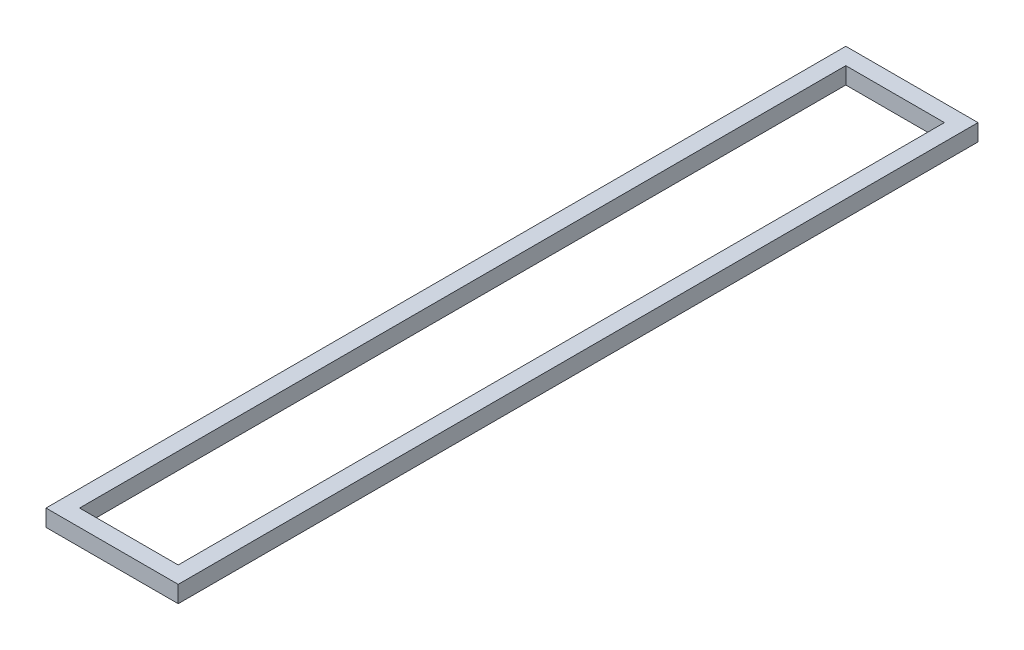
ISO-10303-21;
HEADER;
FILE_DESCRIPTION(('STEP AP214'),'2;1');
FILE_NAME('part.step','',(''),(''),'','','');
FILE_SCHEMA(('AUTOMOTIVE_DESIGN { 1 0 10303 214 1 1 1 1 }'));
ENDSEC;
DATA;
#1=APPLICATION_CONTEXT('core data for automotive mechanical design processes');
#2=APPLICATION_PROTOCOL_DEFINITION('international standard','automotive_design',2000,#1);
#3=PRODUCT_CONTEXT('',#1,'mechanical');
#4=PRODUCT('Part','Part','',(#3));
#5=PRODUCT_RELATED_PRODUCT_CATEGORY('part','',(#4));
#6=PRODUCT_DEFINITION_FORMATION('','',#4);
#7=PRODUCT_DEFINITION_CONTEXT('part definition',#1,'design');
#8=PRODUCT_DEFINITION('design','',#6,#7);
#9=PRODUCT_DEFINITION_SHAPE('','',#8);
#10=(LENGTH_UNIT() NAMED_UNIT(*) SI_UNIT(.MILLI.,.METRE.));
#11=(NAMED_UNIT(*) PLANE_ANGLE_UNIT() SI_UNIT($,.RADIAN.));
#12=(NAMED_UNIT(*) SI_UNIT($,.STERADIAN.) SOLID_ANGLE_UNIT());
#13=UNCERTAINTY_MEASURE_WITH_UNIT(LENGTH_MEASURE(1.E-05),#10,'distance_accuracy_value','');
#14=(GEOMETRIC_REPRESENTATION_CONTEXT(3) GLOBAL_UNCERTAINTY_ASSIGNED_CONTEXT((#13)) GLOBAL_UNIT_ASSIGNED_CONTEXT((#10,
#11,#12)) REPRESENTATION_CONTEXT('',''));
#15=CARTESIAN_POINT('',(0.,0.,0.));
#16=DIRECTION('',(0.,0.,1.));
#17=DIRECTION('',(1.,0.,0.));
#18=AXIS2_PLACEMENT_3D('',#15,#16,#17);
#19=CARTESIAN_POINT('',(-100.,0.,-605.));
#20=DIRECTION('',(-1.,0.,0.));
#21=DIRECTION('',(0.,0.,1.));
#22=AXIS2_PLACEMENT_3D('',#19,#20,#21);
#23=PLANE('',#22);
#24=DIRECTION('',(0.,0.,1.));
#25=VECTOR('',#24,1.);
#26=CARTESIAN_POINT('',(-100.,0.,-605.));
#27=LINE('',#26,#25);
#28=CARTESIAN_POINT('',(-100.,0.,-605.));
#29=VERTEX_POINT('',#28);
#30=CARTESIAN_POINT('',(-100.,0.,605.));
#31=VERTEX_POINT('',#30);
#32=EDGE_CURVE('E133',#29,#31,#27,.T.);
#33=ORIENTED_EDGE('',*,*,#32,.T.);
#34=DIRECTION('',(0.,-1.,0.));
#35=VECTOR('',#34,1.);
#36=CARTESIAN_POINT('',(-99.9999999999999,0.,605.));
#37=LINE('',#36,#35);
#38=CARTESIAN_POINT('',(-100.,25.4,605.));
#39=VERTEX_POINT('',#38);
#40=EDGE_CURVE('E168',#39,#31,#37,.T.);
#41=ORIENTED_EDGE('',*,*,#40,.F.);
#42=DIRECTION('',(0.,0.,1.));
#43=VECTOR('',#42,1.);
#44=CARTESIAN_POINT('',(-100.,25.4,-605.));
#45=LINE('',#44,#43);
#46=CARTESIAN_POINT('',(-100.,25.4,-605.));
#47=VERTEX_POINT('',#46);
#48=EDGE_CURVE('E148',#47,#39,#45,.T.);
#49=ORIENTED_EDGE('',*,*,#48,.F.);
#50=DIRECTION('',(0.,-1.,0.));
#51=VECTOR('',#50,1.);
#52=CARTESIAN_POINT('',(-100.,0.,-605.));
#53=LINE('',#52,#51);
#54=EDGE_CURVE('E223',#47,#29,#53,.T.);
#55=ORIENTED_EDGE('',*,*,#54,.T.);
#56=EDGE_LOOP('',(#33,#41,#49,#55));
#57=FACE_BOUND('',#56,.T.);
#58=ADVANCED_FACE('F37',(#57),#23,.T.);
#59=CARTESIAN_POINT('',(-74.6000000000002,0.,-605.));
#60=DIRECTION('',(1.,0.,0.));
#61=DIRECTION('',(0.,0.,-1.));
#62=AXIS2_PLACEMENT_3D('',#59,#60,#61);
#63=PLANE('',#62);
#64=DIRECTION('',(0.,0.,1.));
#65=VECTOR('',#64,1.);
#66=CARTESIAN_POINT('',(-74.6000000000002,25.4,-605.));
#67=LINE('',#66,#65);
#68=CARTESIAN_POINT('',(-74.6000000000002,25.4,-579.6));
#69=VERTEX_POINT('',#68);
#70=CARTESIAN_POINT('',(-74.6,25.4,579.6));
#71=VERTEX_POINT('',#70);
#72=EDGE_CURVE('E41',#69,#71,#67,.T.);
#73=ORIENTED_EDGE('',*,*,#72,.T.);
#74=DIRECTION('',(0.,-1.,0.));
#75=VECTOR('',#74,1.);
#76=CARTESIAN_POINT('',(-74.6,0.,579.6));
#77=LINE('',#76,#75);
#78=CARTESIAN_POINT('',(-74.6,0.,579.6));
#79=VERTEX_POINT('',#78);
#80=EDGE_CURVE('E140',#71,#79,#77,.T.);
#81=ORIENTED_EDGE('',*,*,#80,.T.);
#82=DIRECTION('',(0.,0.,1.));
#83=VECTOR('',#82,1.);
#84=CARTESIAN_POINT('',(-74.6000000000002,0.,-605.));
#85=LINE('',#84,#83);
#86=CARTESIAN_POINT('',(-74.6000000000002,0.,-579.6));
#87=VERTEX_POINT('',#86);
#88=EDGE_CURVE('E149',#87,#79,#85,.T.);
#89=ORIENTED_EDGE('',*,*,#88,.F.);
#90=DIRECTION('',(0.,-1.,0.));
#91=VECTOR('',#90,1.);
#92=CARTESIAN_POINT('',(-74.6000000000002,0.,-579.6));
#93=LINE('',#92,#91);
#94=EDGE_CURVE('E143',#69,#87,#93,.T.);
#95=ORIENTED_EDGE('',*,*,#94,.F.);
#96=EDGE_LOOP('',(#73,#81,#89,#95));
#97=FACE_BOUND('',#96,.T.);
#98=ADVANCED_FACE('F139',(#97),#63,.T.);
#99=CARTESIAN_POINT('',(-100.,25.4,-605.));
#100=DIRECTION('',(0.,1.,0.));
#101=DIRECTION('',(0.,0.,1.));
#102=AXIS2_PLACEMENT_3D('',#99,#100,#101);
#103=PLANE('',#102);
#104=DIRECTION('',(1.,0.,0.));
#105=VECTOR('',#104,1.);
#106=CARTESIAN_POINT('',(-99.9999999999999,25.4,579.6));
#107=LINE('',#106,#105);
#108=CARTESIAN_POINT('',(74.6000000000002,25.4,579.6));
#109=VERTEX_POINT('',#108);
#110=EDGE_CURVE('E153',#71,#109,#107,.T.);
#111=ORIENTED_EDGE('',*,*,#110,.F.);
#112=ORIENTED_EDGE('',*,*,#72,.F.);
#113=DIRECTION('',(-1.,0.,0.));
#114=VECTOR('',#113,1.);
#115=CARTESIAN_POINT('',(100.,25.4,-579.6));
#116=LINE('',#115,#114);
#117=CARTESIAN_POINT('',(74.6000000000001,25.4,-579.6));
#118=VERTEX_POINT('',#117);
#119=EDGE_CURVE('E182',#118,#69,#116,.T.);
#120=ORIENTED_EDGE('',*,*,#119,.F.);
#121=DIRECTION('',(0.,0.,-1.));
#122=VECTOR('',#121,1.);
#123=CARTESIAN_POINT('',(74.6000000000002,25.4,605.));
#124=LINE('',#123,#122);
#125=EDGE_CURVE('E163',#109,#118,#124,.T.);
#126=ORIENTED_EDGE('',*,*,#125,.F.);
#127=EDGE_LOOP('',(#111,#112,#120,#126));
#128=FACE_BOUND('',#127,.T.);
#129=ORIENTED_EDGE('',*,*,#48,.T.);
#130=DIRECTION('',(1.,0.,0.));
#131=VECTOR('',#130,1.);
#132=CARTESIAN_POINT('',(-99.9999999999999,25.4,605.));
#133=LINE('',#132,#131);
#134=CARTESIAN_POINT('',(100.,25.4,605.));
#135=VERTEX_POINT('',#134);
#136=EDGE_CURVE('E164',#39,#135,#133,.T.);
#137=ORIENTED_EDGE('',*,*,#136,.T.);
#138=DIRECTION('',(0.,0.,-1.));
#139=VECTOR('',#138,1.);
#140=CARTESIAN_POINT('',(100.,25.4,605.));
#141=LINE('',#140,#139);
#142=CARTESIAN_POINT('',(100.,25.4,-605.));
#143=VERTEX_POINT('',#142);
#144=EDGE_CURVE('E206',#135,#143,#141,.T.);
#145=ORIENTED_EDGE('',*,*,#144,.T.);
#146=DIRECTION('',(-1.,0.,0.));
#147=VECTOR('',#146,1.);
#148=CARTESIAN_POINT('',(100.,25.4,-605.));
#149=LINE('',#148,#147);
#150=EDGE_CURVE('E189',#143,#47,#149,.T.);
#151=ORIENTED_EDGE('',*,*,#150,.T.);
#152=EDGE_LOOP('',(#129,#137,#145,#151));
#153=FACE_BOUND('',#152,.T.);
#154=ADVANCED_FACE('F160',(#128,#153),#103,.T.);
#155=CARTESIAN_POINT('',(-100.,0.,-605.));
#156=DIRECTION('',(0.,-1.,0.));
#157=DIRECTION('',(0.,0.,-1.));
#158=AXIS2_PLACEMENT_3D('',#155,#156,#157);
#159=PLANE('',#158);
#160=DIRECTION('',(1.,0.,0.));
#161=VECTOR('',#160,1.);
#162=CARTESIAN_POINT('',(-99.9999999999999,0.,605.));
#163=LINE('',#162,#161);
#164=CARTESIAN_POINT('',(100.,0.,605.));
#165=VERTEX_POINT('',#164);
#166=EDGE_CURVE('E157',#31,#165,#163,.T.);
#167=ORIENTED_EDGE('',*,*,#166,.F.);
#168=ORIENTED_EDGE('',*,*,#32,.F.);
#169=DIRECTION('',(-1.,0.,0.));
#170=VECTOR('',#169,1.);
#171=CARTESIAN_POINT('',(100.,0.,-605.));
#172=LINE('',#171,#170);
#173=CARTESIAN_POINT('',(100.,0.,-605.));
#174=VERTEX_POINT('',#173);
#175=EDGE_CURVE('E186',#174,#29,#172,.T.);
#176=ORIENTED_EDGE('',*,*,#175,.F.);
#177=DIRECTION('',(0.,0.,-1.));
#178=VECTOR('',#177,1.);
#179=CARTESIAN_POINT('',(100.,0.,605.));
#180=LINE('',#179,#178);
#181=EDGE_CURVE('E204',#165,#174,#180,.T.);
#182=ORIENTED_EDGE('',*,*,#181,.F.);
#183=EDGE_LOOP('',(#167,#168,#176,#182));
#184=FACE_BOUND('',#183,.T.);
#185=ORIENTED_EDGE('',*,*,#88,.T.);
#186=DIRECTION('',(1.,0.,0.));
#187=VECTOR('',#186,1.);
#188=CARTESIAN_POINT('',(-99.9999999999999,0.,579.6));
#189=LINE('',#188,#187);
#190=CARTESIAN_POINT('',(74.6000000000002,0.,579.6));
#191=VERTEX_POINT('',#190);
#192=EDGE_CURVE('E156',#79,#191,#189,.T.);
#193=ORIENTED_EDGE('',*,*,#192,.T.);
#194=DIRECTION('',(0.,0.,-1.));
#195=VECTOR('',#194,1.);
#196=CARTESIAN_POINT('',(74.6000000000002,0.,605.));
#197=LINE('',#196,#195);
#198=CARTESIAN_POINT('',(74.6000000000001,0.,-579.6));
#199=VERTEX_POINT('',#198);
#200=EDGE_CURVE('E207',#191,#199,#197,.T.);
#201=ORIENTED_EDGE('',*,*,#200,.T.);
#202=DIRECTION('',(-1.,0.,0.));
#203=VECTOR('',#202,1.);
#204=CARTESIAN_POINT('',(100.,0.,-579.6));
#205=LINE('',#204,#203);
#206=EDGE_CURVE('E178',#199,#87,#205,.T.);
#207=ORIENTED_EDGE('',*,*,#206,.T.);
#208=EDGE_LOOP('',(#185,#193,#201,#207));
#209=FACE_BOUND('',#208,.T.);
#210=ADVANCED_FACE('F39',(#184,#209),#159,.T.);
#211=CARTESIAN_POINT('',(-99.9999999999999,0.,605.));
#212=DIRECTION('',(0.,0.,1.));
#213=DIRECTION('',(1.,0.,0.));
#214=AXIS2_PLACEMENT_3D('',#211,#212,#213);
#215=PLANE('',#214);
#216=ORIENTED_EDGE('',*,*,#166,.T.);
#217=DIRECTION('',(0.,-1.,0.));
#218=VECTOR('',#217,1.);
#219=CARTESIAN_POINT('',(100.,0.,605.));
#220=LINE('',#219,#218);
#221=EDGE_CURVE('E196',#135,#165,#220,.T.);
#222=ORIENTED_EDGE('',*,*,#221,.F.);
#223=ORIENTED_EDGE('',*,*,#136,.F.);
#224=ORIENTED_EDGE('',*,*,#40,.T.);
#225=EDGE_LOOP('',(#216,#222,#223,#224));
#226=FACE_BOUND('',#225,.T.);
#227=ADVANCED_FACE('F194',(#226),#215,.T.);
#228=CARTESIAN_POINT('',(-99.9999999999999,0.,579.6));
#229=DIRECTION('',(0.,0.,-1.));
#230=DIRECTION('',(-1.,0.,0.));
#231=AXIS2_PLACEMENT_3D('',#228,#229,#230);
#232=PLANE('',#231);
#233=ORIENTED_EDGE('',*,*,#110,.T.);
#234=DIRECTION('',(0.,-1.,0.));
#235=VECTOR('',#234,1.);
#236=CARTESIAN_POINT('',(74.6000000000002,0.,579.6));
#237=LINE('',#236,#235);
#238=EDGE_CURVE('E208',#109,#191,#237,.T.);
#239=ORIENTED_EDGE('',*,*,#238,.T.);
#240=ORIENTED_EDGE('',*,*,#192,.F.);
#241=ORIENTED_EDGE('',*,*,#80,.F.);
#242=EDGE_LOOP('',(#233,#239,#240,#241));
#243=FACE_BOUND('',#242,.T.);
#244=ADVANCED_FACE('F152',(#243),#232,.T.);
#245=CARTESIAN_POINT('',(100.,0.,-605.));
#246=DIRECTION('',(0.,0.,-1.));
#247=DIRECTION('',(-1.,0.,0.));
#248=AXIS2_PLACEMENT_3D('',#245,#246,#247);
#249=PLANE('',#248);
#250=ORIENTED_EDGE('',*,*,#175,.T.);
#251=ORIENTED_EDGE('',*,*,#54,.F.);
#252=ORIENTED_EDGE('',*,*,#150,.F.);
#253=DIRECTION('',(0.,-1.,0.));
#254=VECTOR('',#253,1.);
#255=CARTESIAN_POINT('',(100.,0.,-605.));
#256=LINE('',#255,#254);
#257=EDGE_CURVE('E213',#143,#174,#256,.T.);
#258=ORIENTED_EDGE('',*,*,#257,.T.);
#259=EDGE_LOOP('',(#250,#251,#252,#258));
#260=FACE_BOUND('',#259,.T.);
#261=ADVANCED_FACE('F226',(#260),#249,.T.);
#262=CARTESIAN_POINT('',(100.,0.,-579.6));
#263=DIRECTION('',(0.,0.,1.));
#264=DIRECTION('',(1.,0.,0.));
#265=AXIS2_PLACEMENT_3D('',#262,#263,#264);
#266=PLANE('',#265);
#267=ORIENTED_EDGE('',*,*,#119,.T.);
#268=ORIENTED_EDGE('',*,*,#94,.T.);
#269=ORIENTED_EDGE('',*,*,#206,.F.);
#270=DIRECTION('',(0.,-1.,0.));
#271=VECTOR('',#270,1.);
#272=CARTESIAN_POINT('',(74.6000000000001,0.,-579.6));
#273=LINE('',#272,#271);
#274=EDGE_CURVE('E212',#118,#199,#273,.T.);
#275=ORIENTED_EDGE('',*,*,#274,.F.);
#276=EDGE_LOOP('',(#267,#268,#269,#275));
#277=FACE_BOUND('',#276,.T.);
#278=ADVANCED_FACE('F180',(#277),#266,.T.);
#279=CARTESIAN_POINT('',(100.,0.,605.));
#280=DIRECTION('',(1.,0.,0.));
#281=DIRECTION('',(0.,0.,-1.));
#282=AXIS2_PLACEMENT_3D('',#279,#280,#281);
#283=PLANE('',#282);
#284=ORIENTED_EDGE('',*,*,#181,.T.);
#285=ORIENTED_EDGE('',*,*,#257,.F.);
#286=ORIENTED_EDGE('',*,*,#144,.F.);
#287=ORIENTED_EDGE('',*,*,#221,.T.);
#288=EDGE_LOOP('',(#284,#285,#286,#287));
#289=FACE_BOUND('',#288,.T.);
#290=ADVANCED_FACE('F202',(#289),#283,.T.);
#291=CARTESIAN_POINT('',(74.6000000000002,0.,605.));
#292=DIRECTION('',(-1.,0.,0.));
#293=DIRECTION('',(0.,0.,1.));
#294=AXIS2_PLACEMENT_3D('',#291,#292,#293);
#295=PLANE('',#294);
#296=ORIENTED_EDGE('',*,*,#238,.F.);
#297=ORIENTED_EDGE('',*,*,#125,.T.);
#298=ORIENTED_EDGE('',*,*,#274,.T.);
#299=ORIENTED_EDGE('',*,*,#200,.F.);
#300=EDGE_LOOP('',(#296,#297,#298,#299));
#301=FACE_BOUND('',#300,.T.);
#302=ADVANCED_FACE('F330',(#301),#295,.T.);
#303=CLOSED_SHELL('',(#58,#98,#154,#210,#227,#244,#261,#278,#290,#302));
#304=CARTESIAN_POINT('',(-98.8000000000002,1.2,-605.));
#305=DIRECTION('',(1.,0.,0.));
#306=DIRECTION('',(0.,0.,-1.));
#307=AXIS2_PLACEMENT_3D('',#304,#305,#306);
#308=PLANE('',#307);
#309=DIRECTION('',(0.,0.,1.));
#310=VECTOR('',#309,1.);
#311=CARTESIAN_POINT('',(-98.8000000000002,24.2,-605.));
#312=LINE('',#311,#310);
#313=CARTESIAN_POINT('',(-98.8000000000002,24.2,-603.8));
#314=VERTEX_POINT('',#313);
#315=CARTESIAN_POINT('',(-98.8,24.2,603.8));
#316=VERTEX_POINT('',#315);
#317=EDGE_CURVE('E229',#314,#316,#312,.T.);
#318=ORIENTED_EDGE('',*,*,#317,.T.);
#319=DIRECTION('',(0.,-1.,0.));
#320=VECTOR('',#319,1.);
#321=CARTESIAN_POINT('',(-98.8,1.2,603.8));
#322=LINE('',#321,#320);
#323=CARTESIAN_POINT('',(-98.8,1.2,603.8));
#324=VERTEX_POINT('',#323);
#325=EDGE_CURVE('E231',#316,#324,#322,.T.);
#326=ORIENTED_EDGE('',*,*,#325,.T.);
#327=DIRECTION('',(0.,0.,1.));
#328=VECTOR('',#327,1.);
#329=CARTESIAN_POINT('',(-98.8000000000002,1.2,-605.));
#330=LINE('',#329,#328);
#331=CARTESIAN_POINT('',(-98.8000000000002,1.2,-603.8));
#332=VERTEX_POINT('',#331);
#333=EDGE_CURVE('E215',#332,#324,#330,.T.);
#334=ORIENTED_EDGE('',*,*,#333,.F.);
#335=DIRECTION('',(0.,-1.,0.));
#336=VECTOR('',#335,1.);
#337=CARTESIAN_POINT('',(-98.8000000000002,1.2,-603.8));
#338=LINE('',#337,#336);
#339=EDGE_CURVE('E258',#314,#332,#338,.T.);
#340=ORIENTED_EDGE('',*,*,#339,.F.);
#341=EDGE_LOOP('',(#318,#326,#334,#340));
#342=FACE_BOUND('',#341,.T.);
#343=ADVANCED_FACE('F314',(#342),#308,.T.);
#344=CARTESIAN_POINT('',(-75.8000000000002,1.2,-605.));
#345=DIRECTION('',(-1.,0.,0.));
#346=DIRECTION('',(0.,0.,1.));
#347=AXIS2_PLACEMENT_3D('',#344,#345,#346);
#348=PLANE('',#347);
#349=DIRECTION('',(0.,0.,1.));
#350=VECTOR('',#349,1.);
#351=CARTESIAN_POINT('',(-75.8000000000002,1.2,-605.));
#352=LINE('',#351,#350);
#353=CARTESIAN_POINT('',(-75.8000000000002,1.2,-580.8));
#354=VERTEX_POINT('',#353);
#355=CARTESIAN_POINT('',(-75.8,1.2,580.8));
#356=VERTEX_POINT('',#355);
#357=EDGE_CURVE('E234',#354,#356,#352,.T.);
#358=ORIENTED_EDGE('',*,*,#357,.T.);
#359=DIRECTION('',(0.,1.,0.));
#360=VECTOR('',#359,1.);
#361=CARTESIAN_POINT('',(-75.7999999999999,1.2,580.8));
#362=LINE('',#361,#360);
#363=CARTESIAN_POINT('',(-75.8,24.2,580.8));
#364=VERTEX_POINT('',#363);
#365=EDGE_CURVE('E250',#356,#364,#362,.T.);
#366=ORIENTED_EDGE('',*,*,#365,.T.);
#367=DIRECTION('',(0.,0.,1.));
#368=VECTOR('',#367,1.);
#369=CARTESIAN_POINT('',(-75.8000000000002,24.2,-605.));
#370=LINE('',#369,#368);
#371=CARTESIAN_POINT('',(-75.8000000000002,24.2,-580.8));
#372=VERTEX_POINT('',#371);
#373=EDGE_CURVE('E232',#372,#364,#370,.T.);
#374=ORIENTED_EDGE('',*,*,#373,.F.);
#375=DIRECTION('',(0.,1.,0.));
#376=VECTOR('',#375,1.);
#377=CARTESIAN_POINT('',(-75.8000000000002,1.2,-580.8));
#378=LINE('',#377,#376);
#379=EDGE_CURVE('E267',#354,#372,#378,.T.);
#380=ORIENTED_EDGE('',*,*,#379,.F.);
#381=EDGE_LOOP('',(#358,#366,#374,#380));
#382=FACE_BOUND('',#381,.T.);
#383=ADVANCED_FACE('F316',(#382),#348,.T.);
#384=CARTESIAN_POINT('',(-99.9999999999999,1.2,603.8));
#385=DIRECTION('',(0.,0.,-1.));
#386=DIRECTION('',(-1.,0.,0.));
#387=AXIS2_PLACEMENT_3D('',#384,#385,#386);
#388=PLANE('',#387);
#389=DIRECTION('',(1.,0.,0.));
#390=VECTOR('',#389,1.);
#391=CARTESIAN_POINT('',(-99.9999999999999,24.2,603.8));
#392=LINE('',#391,#390);
#393=CARTESIAN_POINT('',(98.8000000000002,24.2,603.8));
#394=VERTEX_POINT('',#393);
#395=EDGE_CURVE('E237',#316,#394,#392,.T.);
#396=ORIENTED_EDGE('',*,*,#395,.T.);
#397=DIRECTION('',(0.,-1.,0.));
#398=VECTOR('',#397,1.);
#399=CARTESIAN_POINT('',(98.8000000000002,1.2,603.8));
#400=LINE('',#399,#398);
#401=CARTESIAN_POINT('',(98.8000000000002,1.2,603.8));
#402=VERTEX_POINT('',#401);
#403=EDGE_CURVE('E268',#394,#402,#400,.T.);
#404=ORIENTED_EDGE('',*,*,#403,.T.);
#405=DIRECTION('',(1.,0.,0.));
#406=VECTOR('',#405,1.);
#407=CARTESIAN_POINT('',(-99.9999999999999,1.2,603.8));
#408=LINE('',#407,#406);
#409=EDGE_CURVE('E247',#324,#402,#408,.T.);
#410=ORIENTED_EDGE('',*,*,#409,.F.);
#411=ORIENTED_EDGE('',*,*,#325,.F.);
#412=EDGE_LOOP('',(#396,#404,#410,#411));
#413=FACE_BOUND('',#412,.T.);
#414=ADVANCED_FACE('F304',(#413),#388,.T.);
#415=CARTESIAN_POINT('',(-99.9999999999999,1.2,580.8));
#416=DIRECTION('',(0.,0.,1.));
#417=DIRECTION('',(1.,0.,0.));
#418=AXIS2_PLACEMENT_3D('',#415,#416,#417);
#419=PLANE('',#418);
#420=DIRECTION('',(1.,0.,0.));
#421=VECTOR('',#420,1.);
#422=CARTESIAN_POINT('',(-99.9999999999999,1.2,580.8));
#423=LINE('',#422,#421);
#424=CARTESIAN_POINT('',(75.8000000000001,1.2,580.8));
#425=VERTEX_POINT('',#424);
#426=EDGE_CURVE('E244',#356,#425,#423,.T.);
#427=ORIENTED_EDGE('',*,*,#426,.T.);
#428=DIRECTION('',(0.,1.,0.));
#429=VECTOR('',#428,1.);
#430=CARTESIAN_POINT('',(75.8000000000002,1.2,580.8));
#431=LINE('',#430,#429);
#432=CARTESIAN_POINT('',(75.8000000000001,24.2,580.8));
#433=VERTEX_POINT('',#432);
#434=EDGE_CURVE('E281',#425,#433,#431,.T.);
#435=ORIENTED_EDGE('',*,*,#434,.T.);
#436=DIRECTION('',(1.,0.,0.));
#437=VECTOR('',#436,1.);
#438=CARTESIAN_POINT('',(-99.9999999999999,24.2,580.8));
#439=LINE('',#438,#437);
#440=EDGE_CURVE('E241',#364,#433,#439,.T.);
#441=ORIENTED_EDGE('',*,*,#440,.F.);
#442=ORIENTED_EDGE('',*,*,#365,.F.);
#443=EDGE_LOOP('',(#427,#435,#441,#442));
#444=FACE_BOUND('',#443,.T.);
#445=ADVANCED_FACE('F393',(#444),#419,.T.);
#446=CARTESIAN_POINT('',(100.,1.2,-603.8));
#447=DIRECTION('',(0.,0.,1.));
#448=DIRECTION('',(1.,0.,0.));
#449=AXIS2_PLACEMENT_3D('',#446,#447,#448);
#450=PLANE('',#449);
#451=DIRECTION('',(-1.,0.,0.));
#452=VECTOR('',#451,1.);
#453=CARTESIAN_POINT('',(100.,24.2,-603.8));
#454=LINE('',#453,#452);
#455=CARTESIAN_POINT('',(98.8000000000001,24.2,-603.8));
#456=VERTEX_POINT('',#455);
#457=EDGE_CURVE('E255',#456,#314,#454,.T.);
#458=ORIENTED_EDGE('',*,*,#457,.T.);
#459=ORIENTED_EDGE('',*,*,#339,.T.);
#460=DIRECTION('',(-1.,0.,0.));
#461=VECTOR('',#460,1.);
#462=CARTESIAN_POINT('',(100.,1.2,-603.8));
#463=LINE('',#462,#461);
#464=CARTESIAN_POINT('',(98.8000000000001,1.2,-603.8));
#465=VERTEX_POINT('',#464);
#466=EDGE_CURVE('E240',#465,#332,#463,.T.);
#467=ORIENTED_EDGE('',*,*,#466,.F.);
#468=DIRECTION('',(0.,-1.,0.));
#469=VECTOR('',#468,1.);
#470=CARTESIAN_POINT('',(98.8000000000001,1.2,-603.8));
#471=LINE('',#470,#469);
#472=EDGE_CURVE('E278',#456,#465,#471,.T.);
#473=ORIENTED_EDGE('',*,*,#472,.F.);
#474=EDGE_LOOP('',(#458,#459,#467,#473));
#475=FACE_BOUND('',#474,.T.);
#476=ADVANCED_FACE('F312',(#475),#450,.T.);
#477=CARTESIAN_POINT('',(100.,1.2,-580.8));
#478=DIRECTION('',(0.,0.,-1.));
#479=DIRECTION('',(-1.,0.,0.));
#480=AXIS2_PLACEMENT_3D('',#477,#478,#479);
#481=PLANE('',#480);
#482=DIRECTION('',(-1.,0.,0.));
#483=VECTOR('',#482,1.);
#484=CARTESIAN_POINT('',(100.,1.2,-580.8));
#485=LINE('',#484,#483);
#486=CARTESIAN_POINT('',(75.8,1.2,-580.8));
#487=VERTEX_POINT('',#486);
#488=EDGE_CURVE('E260',#487,#354,#485,.T.);
#489=ORIENTED_EDGE('',*,*,#488,.T.);
#490=ORIENTED_EDGE('',*,*,#379,.T.);
#491=DIRECTION('',(-1.,0.,0.));
#492=VECTOR('',#491,1.);
#493=CARTESIAN_POINT('',(100.,24.2,-580.8));
#494=LINE('',#493,#492);
#495=CARTESIAN_POINT('',(75.8000000000001,24.2,-580.8));
#496=VERTEX_POINT('',#495);
#497=EDGE_CURVE('E56',#496,#372,#494,.T.);
#498=ORIENTED_EDGE('',*,*,#497,.F.);
#499=DIRECTION('',(0.,1.,0.));
#500=VECTOR('',#499,1.);
#501=CARTESIAN_POINT('',(75.8000000000001,1.2,-580.8));
#502=LINE('',#501,#500);
#503=EDGE_CURVE('E284',#487,#496,#502,.T.);
#504=ORIENTED_EDGE('',*,*,#503,.F.);
#505=EDGE_LOOP('',(#489,#490,#498,#504));
#506=FACE_BOUND('',#505,.T.);
#507=ADVANCED_FACE('F410',(#506),#481,.T.);
#508=CARTESIAN_POINT('',(98.8000000000002,1.2,605.));
#509=DIRECTION('',(-1.,0.,0.));
#510=DIRECTION('',(0.,0.,1.));
#511=AXIS2_PLACEMENT_3D('',#508,#509,#510);
#512=PLANE('',#511);
#513=ORIENTED_EDGE('',*,*,#403,.F.);
#514=DIRECTION('',(0.,0.,-1.));
#515=VECTOR('',#514,1.);
#516=CARTESIAN_POINT('',(98.8000000000002,24.2,605.));
#517=LINE('',#516,#515);
#518=EDGE_CURVE('E11',#394,#456,#517,.T.);
#519=ORIENTED_EDGE('',*,*,#518,.T.);
#520=ORIENTED_EDGE('',*,*,#472,.T.);
#521=DIRECTION('',(0.,0.,-1.));
#522=VECTOR('',#521,1.);
#523=CARTESIAN_POINT('',(98.8000000000002,1.2,605.));
#524=LINE('',#523,#522);
#525=EDGE_CURVE('E275',#402,#465,#524,.T.);
#526=ORIENTED_EDGE('',*,*,#525,.F.);
#527=EDGE_LOOP('',(#513,#519,#520,#526));
#528=FACE_BOUND('',#527,.T.);
#529=ADVANCED_FACE('F291',(#528),#512,.T.);
#530=CARTESIAN_POINT('',(98.8000000000002,1.2,605.));
#531=DIRECTION('',(0.,1.,0.));
#532=DIRECTION('',(0.,0.,1.));
#533=AXIS2_PLACEMENT_3D('',#530,#531,#532);
#534=PLANE('',#533);
#535=ORIENTED_EDGE('',*,*,#426,.F.);
#536=ORIENTED_EDGE('',*,*,#357,.F.);
#537=ORIENTED_EDGE('',*,*,#488,.F.);
#538=DIRECTION('',(0.,0.,-1.));
#539=VECTOR('',#538,1.);
#540=CARTESIAN_POINT('',(75.8000000000002,1.2,605.));
#541=LINE('',#540,#539);
#542=EDGE_CURVE('E272',#425,#487,#541,.T.);
#543=ORIENTED_EDGE('',*,*,#542,.F.);
#544=EDGE_LOOP('',(#535,#536,#537,#543));
#545=FACE_BOUND('',#544,.T.);
#546=ORIENTED_EDGE('',*,*,#333,.T.);
#547=ORIENTED_EDGE('',*,*,#409,.T.);
#548=ORIENTED_EDGE('',*,*,#525,.T.);
#549=ORIENTED_EDGE('',*,*,#466,.T.);
#550=EDGE_LOOP('',(#546,#547,#548,#549));
#551=FACE_BOUND('',#550,.T.);
#552=ADVANCED_FACE('F298',(#545,#551),#534,.T.);
#553=CARTESIAN_POINT('',(75.8000000000002,1.2,605.));
#554=DIRECTION('',(1.,0.,0.));
#555=DIRECTION('',(0.,0.,-1.));
#556=AXIS2_PLACEMENT_3D('',#553,#554,#555);
#557=PLANE('',#556);
#558=ORIENTED_EDGE('',*,*,#434,.F.);
#559=ORIENTED_EDGE('',*,*,#542,.T.);
#560=ORIENTED_EDGE('',*,*,#503,.T.);
#561=DIRECTION('',(0.,0.,-1.));
#562=VECTOR('',#561,1.);
#563=CARTESIAN_POINT('',(75.8000000000002,24.2,605.));
#564=LINE('',#563,#562);
#565=EDGE_CURVE('E47',#433,#496,#564,.T.);
#566=ORIENTED_EDGE('',*,*,#565,.F.);
#567=EDGE_LOOP('',(#558,#559,#560,#566));
#568=FACE_BOUND('',#567,.T.);
#569=ADVANCED_FACE('F436',(#568),#557,.T.);
#570=CARTESIAN_POINT('',(98.8000000000002,24.2,605.));
#571=DIRECTION('',(0.,-1.,0.));
#572=DIRECTION('',(0.,0.,-1.));
#573=AXIS2_PLACEMENT_3D('',#570,#571,#572);
#574=PLANE('',#573);
#575=ORIENTED_EDGE('',*,*,#395,.F.);
#576=ORIENTED_EDGE('',*,*,#317,.F.);
#577=ORIENTED_EDGE('',*,*,#457,.F.);
#578=ORIENTED_EDGE('',*,*,#518,.F.);
#579=EDGE_LOOP('',(#575,#576,#577,#578));
#580=FACE_BOUND('',#579,.T.);
#581=ORIENTED_EDGE('',*,*,#373,.T.);
#582=ORIENTED_EDGE('',*,*,#440,.T.);
#583=ORIENTED_EDGE('',*,*,#565,.T.);
#584=ORIENTED_EDGE('',*,*,#497,.T.);
#585=EDGE_LOOP('',(#581,#582,#583,#584));
#586=FACE_BOUND('',#585,.T.);
#587=ADVANCED_FACE('F309',(#580,#586),#574,.T.);
#588=CLOSED_SHELL('',(#343,#383,#414,#445,#476,#507,#529,#552,#569,#587));
#589=ORIENTED_CLOSED_SHELL('',*,#588,.T.);
#590=BREP_WITH_VOIDS('B2',#303,(#589));
#591=ADVANCED_BREP_SHAPE_REPRESENTATION('',(#18,#590),#14);
#592=SHAPE_DEFINITION_REPRESENTATION(#9,#591);
ENDSEC;
END-ISO-10303-21;
